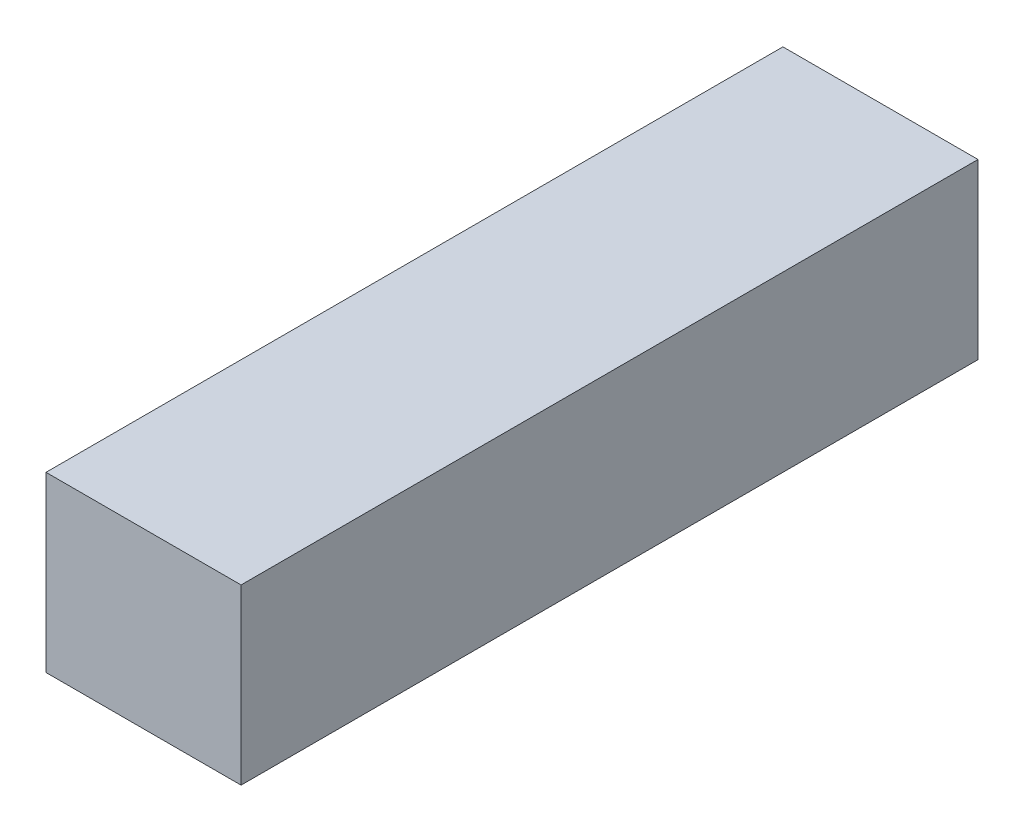
ISO-10303-21;
HEADER;
FILE_DESCRIPTION(('STEP AP214'),'2;1');
FILE_NAME('part.step','',(''),(''),'','','');
FILE_SCHEMA(('AUTOMOTIVE_DESIGN { 1 0 10303 214 1 1 1 1 }'));
ENDSEC;
DATA;
#1=APPLICATION_CONTEXT('core data for automotive mechanical design processes');
#2=APPLICATION_PROTOCOL_DEFINITION('international standard','automotive_design',2000,#1);
#3=PRODUCT_CONTEXT('',#1,'mechanical');
#4=PRODUCT('Part','Part','',(#3));
#5=PRODUCT_RELATED_PRODUCT_CATEGORY('part','',(#4));
#6=PRODUCT_DEFINITION_FORMATION('','',#4);
#7=PRODUCT_DEFINITION_CONTEXT('part definition',#1,'design');
#8=PRODUCT_DEFINITION('design','',#6,#7);
#9=PRODUCT_DEFINITION_SHAPE('','',#8);
#10=(LENGTH_UNIT() NAMED_UNIT(*) SI_UNIT(.MILLI.,.METRE.));
#11=(NAMED_UNIT(*) PLANE_ANGLE_UNIT() SI_UNIT($,.RADIAN.));
#12=(NAMED_UNIT(*) SI_UNIT($,.STERADIAN.) SOLID_ANGLE_UNIT());
#13=UNCERTAINTY_MEASURE_WITH_UNIT(LENGTH_MEASURE(1.E-05),#10,'distance_accuracy_value','');
#14=(GEOMETRIC_REPRESENTATION_CONTEXT(3) GLOBAL_UNCERTAINTY_ASSIGNED_CONTEXT((#13)) GLOBAL_UNIT_ASSIGNED_CONTEXT((#10,
#11,#12)) REPRESENTATION_CONTEXT('',''));
#15=CARTESIAN_POINT('',(0.,0.,0.));
#16=DIRECTION('',(0.,0.,1.));
#17=DIRECTION('',(1.,0.,0.));
#18=AXIS2_PLACEMENT_3D('',#15,#16,#17);
#19=CARTESIAN_POINT('',(-36.1155647631057,22.4038461538461,170.));
#20=DIRECTION('',(1.,0.,0.));
#21=DIRECTION('',(0.,0.,-1.));
#22=AXIS2_PLACEMENT_3D('',#19,#20,#21);
#23=PLANE('',#22);
#24=DIRECTION('',(0.,-1.,0.));
#25=VECTOR('',#24,1.);
#26=CARTESIAN_POINT('',(-36.1155647631057,22.4038461538461,0.));
#27=LINE('',#26,#25);
#28=CARTESIAN_POINT('',(-36.1155647631057,22.4038461538461,0.));
#29=VERTEX_POINT('',#28);
#30=CARTESIAN_POINT('',(-36.1155647631057,-17.5961538461539,0.));
#31=VERTEX_POINT('',#30);
#32=EDGE_CURVE('E96',#29,#31,#27,.T.);
#33=ORIENTED_EDGE('',*,*,#32,.T.);
#34=DIRECTION('',(0.,0.,-1.));
#35=VECTOR('',#34,1.);
#36=CARTESIAN_POINT('',(-36.1155647631057,-17.5961538461539,170.));
#37=LINE('',#36,#35);
#38=CARTESIAN_POINT('',(-36.1155647631057,-17.5961538461539,170.));
#39=VERTEX_POINT('',#38);
#40=EDGE_CURVE('E11',#39,#31,#37,.T.);
#41=ORIENTED_EDGE('',*,*,#40,.F.);
#42=DIRECTION('',(0.,-1.,0.));
#43=VECTOR('',#42,1.);
#44=CARTESIAN_POINT('',(-36.1155647631057,22.4038461538461,170.));
#45=LINE('',#44,#43);
#46=CARTESIAN_POINT('',(-36.1155647631057,22.4038461538461,170.));
#47=VERTEX_POINT('',#46);
#48=EDGE_CURVE('E84',#47,#39,#45,.T.);
#49=ORIENTED_EDGE('',*,*,#48,.F.);
#50=DIRECTION('',(0.,0.,-1.));
#51=VECTOR('',#50,1.);
#52=CARTESIAN_POINT('',(-36.1155647631057,22.4038461538461,170.));
#53=LINE('',#52,#51);
#54=EDGE_CURVE('E92',#47,#29,#53,.T.);
#55=ORIENTED_EDGE('',*,*,#54,.T.);
#56=EDGE_LOOP('',(#33,#41,#49,#55));
#57=FACE_BOUND('',#56,.T.);
#58=ADVANCED_FACE('F33',(#57),#23,.F.);
#59=CARTESIAN_POINT('',(-36.1155647631057,-17.5961538461539,170.));
#60=DIRECTION('',(0.,1.,0.));
#61=DIRECTION('',(0.,0.,1.));
#62=AXIS2_PLACEMENT_3D('',#59,#60,#61);
#63=PLANE('',#62);
#64=DIRECTION('',(1.,0.,0.));
#65=VECTOR('',#64,1.);
#66=CARTESIAN_POINT('',(-36.1155647631057,-17.5961538461539,0.));
#67=LINE('',#66,#65);
#68=CARTESIAN_POINT('',(8.88443523689427,-17.5961538461539,0.));
#69=VERTEX_POINT('',#68);
#70=EDGE_CURVE('E88',#31,#69,#67,.T.);
#71=ORIENTED_EDGE('',*,*,#70,.T.);
#72=DIRECTION('',(0.,0.,-1.));
#73=VECTOR('',#72,1.);
#74=CARTESIAN_POINT('',(8.88443523689427,-17.5961538461539,170.));
#75=LINE('',#74,#73);
#76=CARTESIAN_POINT('',(8.88443523689427,-17.5961538461539,170.));
#77=VERTEX_POINT('',#76);
#78=EDGE_CURVE('E41',#77,#69,#75,.T.);
#79=ORIENTED_EDGE('',*,*,#78,.F.);
#80=DIRECTION('',(1.,0.,0.));
#81=VECTOR('',#80,1.);
#82=CARTESIAN_POINT('',(-36.1155647631057,-17.5961538461539,170.));
#83=LINE('',#82,#81);
#84=EDGE_CURVE('E79',#39,#77,#83,.T.);
#85=ORIENTED_EDGE('',*,*,#84,.F.);
#86=ORIENTED_EDGE('',*,*,#40,.T.);
#87=EDGE_LOOP('',(#71,#79,#85,#86));
#88=FACE_BOUND('',#87,.T.);
#89=ADVANCED_FACE('F87',(#88),#63,.F.);
#90=CARTESIAN_POINT('',(8.88443523689426,22.4038461538461,170.));
#91=DIRECTION('',(-1.,0.,0.));
#92=DIRECTION('',(0.,-1.,0.));
#93=AXIS2_PLACEMENT_3D('',#90,#91,#92);
#94=PLANE('',#93);
#95=DIRECTION('',(0.,1.,0.));
#96=VECTOR('',#95,1.);
#97=CARTESIAN_POINT('',(8.88443523689426,22.4038461538461,0.));
#98=LINE('',#97,#96);
#99=CARTESIAN_POINT('',(8.88443523689426,22.4038461538461,0.));
#100=VERTEX_POINT('',#99);
#101=EDGE_CURVE('E66',#69,#100,#98,.T.);
#102=ORIENTED_EDGE('',*,*,#101,.T.);
#103=DIRECTION('',(0.,0.,-1.));
#104=VECTOR('',#103,1.);
#105=CARTESIAN_POINT('',(8.88443523689426,22.4038461538461,170.));
#106=LINE('',#105,#104);
#107=CARTESIAN_POINT('',(8.88443523689426,22.4038461538461,170.));
#108=VERTEX_POINT('',#107);
#109=EDGE_CURVE('E89',#108,#100,#106,.T.);
#110=ORIENTED_EDGE('',*,*,#109,.F.);
#111=DIRECTION('',(0.,1.,0.));
#112=VECTOR('',#111,1.);
#113=CARTESIAN_POINT('',(8.88443523689426,22.4038461538461,170.));
#114=LINE('',#113,#112);
#115=EDGE_CURVE('E82',#77,#108,#114,.T.);
#116=ORIENTED_EDGE('',*,*,#115,.F.);
#117=ORIENTED_EDGE('',*,*,#78,.T.);
#118=EDGE_LOOP('',(#102,#110,#116,#117));
#119=FACE_BOUND('',#118,.T.);
#120=ADVANCED_FACE('F90',(#119),#94,.F.);
#121=CARTESIAN_POINT('',(-36.1155647631057,22.4038461538461,170.));
#122=DIRECTION('',(0.,-1.,0.));
#123=DIRECTION('',(0.,0.,-1.));
#124=AXIS2_PLACEMENT_3D('',#121,#122,#123);
#125=PLANE('',#124);
#126=DIRECTION('',(-1.,0.,0.));
#127=VECTOR('',#126,1.);
#128=CARTESIAN_POINT('',(-36.1155647631057,22.4038461538461,0.));
#129=LINE('',#128,#127);
#130=EDGE_CURVE('E72',#100,#29,#129,.T.);
#131=ORIENTED_EDGE('',*,*,#130,.T.);
#132=ORIENTED_EDGE('',*,*,#54,.F.);
#133=DIRECTION('',(-1.,0.,0.));
#134=VECTOR('',#133,1.);
#135=CARTESIAN_POINT('',(-36.1155647631057,22.4038461538461,170.));
#136=LINE('',#135,#134);
#137=EDGE_CURVE('E49',#108,#47,#136,.T.);
#138=ORIENTED_EDGE('',*,*,#137,.F.);
#139=ORIENTED_EDGE('',*,*,#109,.T.);
#140=EDGE_LOOP('',(#131,#132,#138,#139));
#141=FACE_BOUND('',#140,.T.);
#142=ADVANCED_FACE('F103',(#141),#125,.F.);
#143=CARTESIAN_POINT('',(0.,0.,170.));
#144=DIRECTION('',(0.,0.,1.));
#145=DIRECTION('',(1.,0.,0.));
#146=AXIS2_PLACEMENT_3D('',#143,#144,#145);
#147=PLANE('',#146);
#148=ORIENTED_EDGE('',*,*,#48,.T.);
#149=ORIENTED_EDGE('',*,*,#84,.T.);
#150=ORIENTED_EDGE('',*,*,#115,.T.);
#151=ORIENTED_EDGE('',*,*,#137,.T.);
#152=EDGE_LOOP('',(#148,#149,#150,#151));
#153=FACE_BOUND('',#152,.T.);
#154=ADVANCED_FACE('F80',(#153),#147,.T.);
#155=CARTESIAN_POINT('',(0.,0.,0.));
#156=DIRECTION('',(0.,0.,1.));
#157=DIRECTION('',(1.,0.,0.));
#158=AXIS2_PLACEMENT_3D('',#155,#156,#157);
#159=PLANE('',#158);
#160=ORIENTED_EDGE('',*,*,#32,.F.);
#161=ORIENTED_EDGE('',*,*,#130,.F.);
#162=ORIENTED_EDGE('',*,*,#101,.F.);
#163=ORIENTED_EDGE('',*,*,#70,.F.);
#164=EDGE_LOOP('',(#160,#161,#162,#163));
#165=FACE_BOUND('',#164,.T.);
#166=ADVANCED_FACE('F106',(#165),#159,.F.);
#167=CLOSED_SHELL('',(#58,#89,#120,#142,#154,#166));
#168=MANIFOLD_SOLID_BREP('B2',#167);
#169=ADVANCED_BREP_SHAPE_REPRESENTATION('',(#18,#168),#14);
#170=SHAPE_DEFINITION_REPRESENTATION(#9,#169);
ENDSEC;
END-ISO-10303-21;
